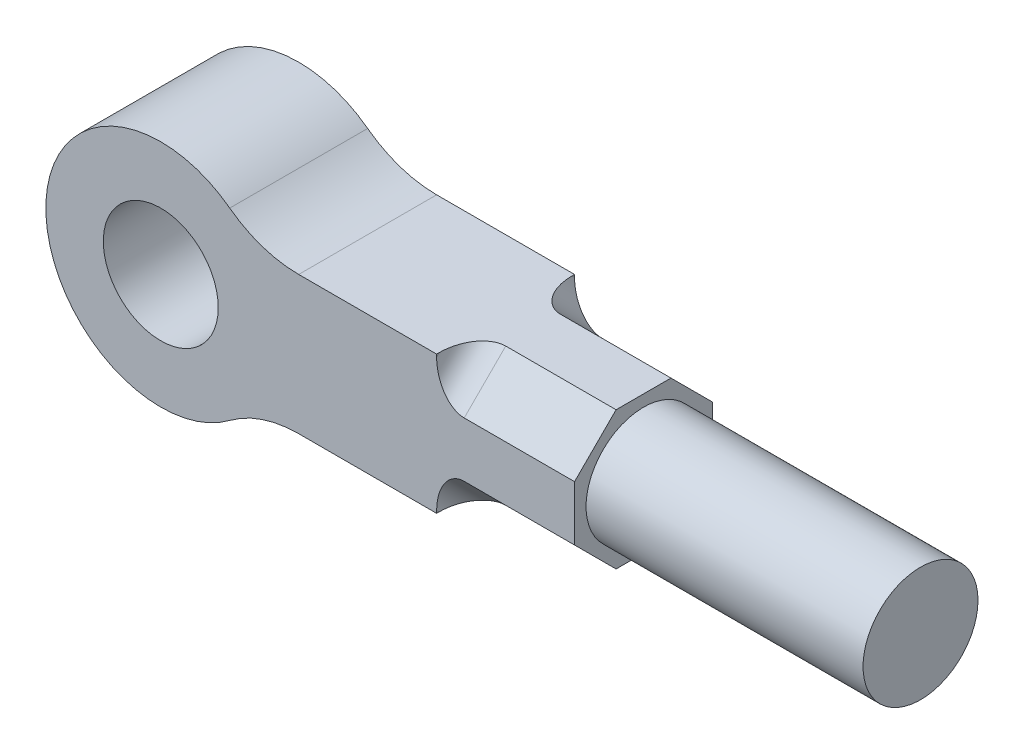
ISO-10303-21;
HEADER;
FILE_DESCRIPTION(('STEP AP214'),'2;1');
FILE_NAME('part.step','',(''),(''),'','','');
FILE_SCHEMA(('AUTOMOTIVE_DESIGN { 1 0 10303 214 1 1 1 1 }'));
ENDSEC;
DATA;
#1=APPLICATION_CONTEXT('core data for automotive mechanical design processes');
#2=APPLICATION_PROTOCOL_DEFINITION('international standard','automotive_design',2000,#1);
#3=PRODUCT_CONTEXT('',#1,'mechanical');
#4=PRODUCT('Part','Part','',(#3));
#5=PRODUCT_RELATED_PRODUCT_CATEGORY('part','',(#4));
#6=PRODUCT_DEFINITION_FORMATION('','',#4);
#7=PRODUCT_DEFINITION_CONTEXT('part definition',#1,'design');
#8=PRODUCT_DEFINITION('design','',#6,#7);
#9=PRODUCT_DEFINITION_SHAPE('','',#8);
#10=(LENGTH_UNIT() NAMED_UNIT(*) SI_UNIT(.MILLI.,.METRE.));
#11=(NAMED_UNIT(*) PLANE_ANGLE_UNIT() SI_UNIT($,.RADIAN.));
#12=(NAMED_UNIT(*) SI_UNIT($,.STERADIAN.) SOLID_ANGLE_UNIT());
#13=UNCERTAINTY_MEASURE_WITH_UNIT(LENGTH_MEASURE(1.E-05),#10,'distance_accuracy_value','');
#14=(GEOMETRIC_REPRESENTATION_CONTEXT(3) GLOBAL_UNCERTAINTY_ASSIGNED_CONTEXT((#13)) GLOBAL_UNIT_ASSIGNED_CONTEXT((#10,
#11,#12)) REPRESENTATION_CONTEXT('',''));
#15=CARTESIAN_POINT('',(0.,0.,0.));
#16=DIRECTION('',(0.,0.,1.));
#17=DIRECTION('',(1.,0.,0.));
#18=AXIS2_PLACEMENT_3D('',#15,#16,#17);
#19=CARTESIAN_POINT('',(600.,800.,600.));
#20=DIRECTION('',(0.,0.,-1.));
#21=DIRECTION('',(-1.,0.,0.));
#22=AXIS2_PLACEMENT_3D('',#19,#20,#21);
#23=PLANE('',#22);
#24=CARTESIAN_POINT('',(0.,0.,600.));
#25=DIRECTION('',(0.,0.,1.));
#26=DIRECTION('',(1.,0.,0.));
#27=AXIS2_PLACEMENT_3D('',#24,#25,#26);
#28=CIRCLE('',#27,250.);
#29=CARTESIAN_POINT('',(250.,0.,600.));
#30=VERTEX_POINT('',#29);
#31=EDGE_CURVE('E336',#30,#30,#28,.T.);
#32=ORIENTED_EDGE('',*,*,#31,.F.);
#33=EDGE_LOOP('',(#32));
#34=FACE_BOUND('',#33,.T.);
#35=DIRECTION('',(0.,-1.,0.));
#36=VECTOR('',#35,1.);
#37=CARTESIAN_POINT('',(1200.,0.,600.));
#38=LINE('',#37,#36);
#39=CARTESIAN_POINT('',(1200.,-289.105627484777,600.));
#40=VERTEX_POINT('',#39);
#41=CARTESIAN_POINT('',(1200.,-300.,600.));
#42=VERTEX_POINT('',#41);
#43=EDGE_CURVE('E371',#40,#42,#38,.T.);
#44=ORIENTED_EDGE('',*,*,#43,.F.);
#45=CARTESIAN_POINT('',(1320.,-289.105627484777,600.));
#46=DIRECTION('',(0.,0.,-1.));
#47=DIRECTION('',(0.,1.,0.));
#48=AXIS2_PLACEMENT_3D('',#45,#46,#47);
#49=ELLIPSE('',#48,169.705627484773,120.);
#50=CARTESIAN_POINT('',(1320.,-119.400000000004,600.));
#51=VERTEX_POINT('',#50);
#52=EDGE_CURVE('E299',#40,#51,#49,.T.);
#53=ORIENTED_EDGE('',*,*,#52,.T.);
#54=DIRECTION('',(1.,0.,0.));
#55=VECTOR('',#54,1.);
#56=CARTESIAN_POINT('',(1200.,-119.400000000004,600.));
#57=LINE('',#56,#55);
#58=CARTESIAN_POINT('',(1800.,-119.400000000004,600.));
#59=VERTEX_POINT('',#58);
#60=EDGE_CURVE('E379',#51,#59,#57,.T.);
#61=ORIENTED_EDGE('',*,*,#60,.T.);
#62=DIRECTION('',(0.,-1.,0.));
#63=VECTOR('',#62,1.);
#64=CARTESIAN_POINT('',(1800.,300.,600.));
#65=LINE('',#64,#63);
#66=CARTESIAN_POINT('',(1800.,119.399999999999,600.));
#67=VERTEX_POINT('',#66);
#68=EDGE_CURVE('E308',#67,#59,#65,.T.);
#69=ORIENTED_EDGE('',*,*,#68,.F.);
#70=DIRECTION('',(1.,0.,0.));
#71=VECTOR('',#70,1.);
#72=CARTESIAN_POINT('',(1200.,119.399999999999,600.));
#73=LINE('',#72,#71);
#74=CARTESIAN_POINT('',(1320.,119.399999999999,600.));
#75=VERTEX_POINT('',#74);
#76=EDGE_CURVE('E399',#75,#67,#73,.T.);
#77=ORIENTED_EDGE('',*,*,#76,.F.);
#78=CARTESIAN_POINT('',(1320.,289.105627484769,600.));
#79=DIRECTION('',(0.,0.,-1.));
#80=DIRECTION('',(0.,1.,0.));
#81=AXIS2_PLACEMENT_3D('',#78,#79,#80);
#82=ELLIPSE('',#81,169.70562748477,120.);
#83=CARTESIAN_POINT('',(1200.,289.105627484769,600.));
#84=VERTEX_POINT('',#83);
#85=EDGE_CURVE('E73',#75,#84,#82,.T.);
#86=ORIENTED_EDGE('',*,*,#85,.T.);
#87=DIRECTION('',(0.,-1.,0.));
#88=VECTOR('',#87,1.);
#89=CARTESIAN_POINT('',(1200.,0.,600.));
#90=LINE('',#89,#88);
#91=CARTESIAN_POINT('',(1200.,300.,600.));
#92=VERTEX_POINT('',#91);
#93=EDGE_CURVE('E391',#92,#84,#90,.T.);
#94=ORIENTED_EDGE('',*,*,#93,.F.);
#95=DIRECTION('',(1.,0.,0.));
#96=VECTOR('',#95,1.);
#97=CARTESIAN_POINT('',(600.,300.,600.));
#98=LINE('',#97,#96);
#99=CARTESIAN_POINT('',(600.,300.,600.));
#100=VERTEX_POINT('',#99);
#101=EDGE_CURVE('E240',#100,#92,#98,.T.);
#102=ORIENTED_EDGE('',*,*,#101,.F.);
#103=CARTESIAN_POINT('',(600.,800.,600.));
#104=DIRECTION('',(0.,0.,-1.));
#105=DIRECTION('',(-1.,0.,0.));
#106=AXIS2_PLACEMENT_3D('',#103,#104,#105);
#107=CIRCLE('',#106,500.);
#108=CARTESIAN_POINT('',(300.,400.,600.));
#109=VERTEX_POINT('',#108);
#110=EDGE_CURVE('E229',#100,#109,#107,.T.);
#111=ORIENTED_EDGE('',*,*,#110,.T.);
#112=CARTESIAN_POINT('',(0.,0.,600.));
#113=DIRECTION('',(0.,0.,1.));
#114=DIRECTION('',(1.,0.,0.));
#115=AXIS2_PLACEMENT_3D('',#112,#113,#114);
#116=CIRCLE('',#115,500.);
#117=CARTESIAN_POINT('',(300.,-400.,600.));
#118=VERTEX_POINT('',#117);
#119=EDGE_CURVE('E318',#109,#118,#116,.T.);
#120=ORIENTED_EDGE('',*,*,#119,.T.);
#121=CARTESIAN_POINT('',(600.,-800.,600.));
#122=DIRECTION('',(0.,0.,-1.));
#123=DIRECTION('',(-1.,0.,0.));
#124=AXIS2_PLACEMENT_3D('',#121,#122,#123);
#125=CIRCLE('',#124,500.);
#126=CARTESIAN_POINT('',(600.,-300.,600.));
#127=VERTEX_POINT('',#126);
#128=EDGE_CURVE('E315',#118,#127,#125,.T.);
#129=ORIENTED_EDGE('',*,*,#128,.T.);
#130=DIRECTION('',(1.,0.,0.));
#131=VECTOR('',#130,1.);
#132=CARTESIAN_POINT('',(600.,-300.,600.));
#133=LINE('',#132,#131);
#134=EDGE_CURVE('E311',#127,#42,#133,.T.);
#135=ORIENTED_EDGE('',*,*,#134,.T.);
#136=EDGE_LOOP('',(#44,#53,#61,#69,#77,#86,#94,#102,#111,#120,#129,#135));
#137=FACE_BOUND('',#136,.T.);
#138=ADVANCED_FACE('F64',(#34,#137),#23,.F.);
#139=CARTESIAN_POINT('',(600.,800.,0.));
#140=DIRECTION('',(0.,0.,-1.));
#141=DIRECTION('',(-1.,0.,0.));
#142=AXIS2_PLACEMENT_3D('',#139,#140,#141);
#143=PLANE('',#142);
#144=CARTESIAN_POINT('',(0.,0.,0.));
#145=DIRECTION('',(0.,0.,1.));
#146=DIRECTION('',(1.,0.,0.));
#147=AXIS2_PLACEMENT_3D('',#144,#145,#146);
#148=CIRCLE('',#147,250.);
#149=CARTESIAN_POINT('',(250.,0.,0.));
#150=VERTEX_POINT('',#149);
#151=EDGE_CURVE('E328',#150,#150,#148,.T.);
#152=ORIENTED_EDGE('',*,*,#151,.T.);
#153=EDGE_LOOP('',(#152));
#154=FACE_BOUND('',#153,.T.);
#155=DIRECTION('',(0.,-1.,0.));
#156=VECTOR('',#155,1.);
#157=CARTESIAN_POINT('',(1800.,300.,0.));
#158=LINE('',#157,#156);
#159=CARTESIAN_POINT('',(1800.,119.4,0.));
#160=VERTEX_POINT('',#159);
#161=CARTESIAN_POINT('',(1800.,-119.400000000009,0.));
#162=VERTEX_POINT('',#161);
#163=EDGE_CURVE('E194',#160,#162,#158,.T.);
#164=ORIENTED_EDGE('',*,*,#163,.T.);
#165=DIRECTION('',(1.,0.,0.));
#166=VECTOR('',#165,1.);
#167=CARTESIAN_POINT('',(1200.,-119.400000000009,0.));
#168=LINE('',#167,#166);
#169=CARTESIAN_POINT('',(1320.,-119.400000000009,0.));
#170=VERTEX_POINT('',#169);
#171=EDGE_CURVE('E214',#170,#162,#168,.T.);
#172=ORIENTED_EDGE('',*,*,#171,.F.);
#173=CARTESIAN_POINT('',(1320.,-289.10562748478,0.));
#174=DIRECTION('',(0.,0.,-1.));
#175=DIRECTION('',(0.,-1.,0.));
#176=AXIS2_PLACEMENT_3D('',#173,#174,#175);
#177=ELLIPSE('',#176,169.705627484771,120.);
#178=CARTESIAN_POINT('',(1200.,-289.10562748478,0.));
#179=VERTEX_POINT('',#178);
#180=EDGE_CURVE('E285',#170,#179,#177,.F.);
#181=ORIENTED_EDGE('',*,*,#180,.T.);
#182=DIRECTION('',(0.,1.,0.));
#183=VECTOR('',#182,1.);
#184=CARTESIAN_POINT('',(1200.,0.,0.));
#185=LINE('',#184,#183);
#186=CARTESIAN_POINT('',(1200.,-300.,0.));
#187=VERTEX_POINT('',#186);
#188=EDGE_CURVE('E354',#187,#179,#185,.T.);
#189=ORIENTED_EDGE('',*,*,#188,.F.);
#190=DIRECTION('',(1.,0.,0.));
#191=VECTOR('',#190,1.);
#192=CARTESIAN_POINT('',(600.,-300.,0.));
#193=LINE('',#192,#191);
#194=CARTESIAN_POINT('',(600.,-300.,0.));
#195=VERTEX_POINT('',#194);
#196=EDGE_CURVE('E224',#195,#187,#193,.T.);
#197=ORIENTED_EDGE('',*,*,#196,.F.);
#198=CARTESIAN_POINT('',(600.,-800.,0.));
#199=DIRECTION('',(0.,0.,-1.));
#200=DIRECTION('',(-1.,0.,0.));
#201=AXIS2_PLACEMENT_3D('',#198,#199,#200);
#202=CIRCLE('',#201,500.);
#203=CARTESIAN_POINT('',(300.,-400.,0.));
#204=VERTEX_POINT('',#203);
#205=EDGE_CURVE('E232',#204,#195,#202,.T.);
#206=ORIENTED_EDGE('',*,*,#205,.F.);
#207=CARTESIAN_POINT('',(0.,0.,0.));
#208=DIRECTION('',(0.,0.,1.));
#209=DIRECTION('',(1.,0.,0.));
#210=AXIS2_PLACEMENT_3D('',#207,#208,#209);
#211=CIRCLE('',#210,500.);
#212=CARTESIAN_POINT('',(300.,400.,0.));
#213=VERTEX_POINT('',#212);
#214=EDGE_CURVE('E335',#213,#204,#211,.T.);
#215=ORIENTED_EDGE('',*,*,#214,.F.);
#216=CARTESIAN_POINT('',(600.,800.,0.));
#217=DIRECTION('',(0.,0.,-1.));
#218=DIRECTION('',(-1.,0.,0.));
#219=AXIS2_PLACEMENT_3D('',#216,#217,#218);
#220=CIRCLE('',#219,500.);
#221=CARTESIAN_POINT('',(600.,300.,0.));
#222=VERTEX_POINT('',#221);
#223=EDGE_CURVE('E331',#222,#213,#220,.T.);
#224=ORIENTED_EDGE('',*,*,#223,.F.);
#225=DIRECTION('',(1.,0.,0.));
#226=VECTOR('',#225,1.);
#227=CARTESIAN_POINT('',(600.,300.,0.));
#228=LINE('',#227,#226);
#229=CARTESIAN_POINT('',(1200.,300.,0.));
#230=VERTEX_POINT('',#229);
#231=EDGE_CURVE('E223',#222,#230,#228,.T.);
#232=ORIENTED_EDGE('',*,*,#231,.T.);
#233=DIRECTION('',(0.,1.,0.));
#234=VECTOR('',#233,1.);
#235=CARTESIAN_POINT('',(1200.,0.,0.));
#236=LINE('',#235,#234);
#237=CARTESIAN_POINT('',(1200.,289.105627484772,0.));
#238=VERTEX_POINT('',#237);
#239=EDGE_CURVE('E213',#238,#230,#236,.T.);
#240=ORIENTED_EDGE('',*,*,#239,.F.);
#241=CARTESIAN_POINT('',(1320.,289.105627484772,0.));
#242=DIRECTION('',(0.,0.,-1.));
#243=DIRECTION('',(0.,-1.,0.));
#244=AXIS2_PLACEMENT_3D('',#241,#242,#243);
#245=ELLIPSE('',#244,169.705627484771,120.);
#246=CARTESIAN_POINT('',(1320.,119.4,0.));
#247=VERTEX_POINT('',#246);
#248=EDGE_CURVE('E197',#238,#247,#245,.F.);
#249=ORIENTED_EDGE('',*,*,#248,.T.);
#250=DIRECTION('',(1.,0.,0.));
#251=VECTOR('',#250,1.);
#252=CARTESIAN_POINT('',(1200.,119.4,0.));
#253=LINE('',#252,#251);
#254=EDGE_CURVE('E189',#247,#160,#253,.T.);
#255=ORIENTED_EDGE('',*,*,#254,.T.);
#256=EDGE_LOOP('',(#164,#172,#181,#189,#197,#206,#215,#224,#232,#240,#249,#255));
#257=FACE_BOUND('',#256,.T.);
#258=ADVANCED_FACE('F191',(#154,#257),#143,.T.);
#259=CARTESIAN_POINT('',(600.,-300.,600.));
#260=DIRECTION('',(0.,1.,0.));
#261=DIRECTION('',(0.,0.,1.));
#262=AXIS2_PLACEMENT_3D('',#259,#260,#261);
#263=PLANE('',#262);
#264=DIRECTION('',(1.,0.,0.));
#265=VECTOR('',#264,1.);
#266=CARTESIAN_POINT('',(1200.,-300.,419.400000000007));
#267=LINE('',#266,#265);
#268=CARTESIAN_POINT('',(1320.,-300.,419.400000000007));
#269=VERTEX_POINT('',#268);
#270=CARTESIAN_POINT('',(1800.,-300.,419.400000000007));
#271=VERTEX_POINT('',#270);
#272=EDGE_CURVE('E368',#269,#271,#267,.T.);
#273=ORIENTED_EDGE('',*,*,#272,.F.);
#274=CARTESIAN_POINT('',(1320.,-300.,589.105627484777));
#275=DIRECTION('',(0.,1.,0.));
#276=DIRECTION('',(0.,0.,1.));
#277=AXIS2_PLACEMENT_3D('',#274,#275,#276);
#278=ELLIPSE('',#277,169.70562748477,120.);
#279=CARTESIAN_POINT('',(1200.,-300.,589.105627484777));
#280=VERTEX_POINT('',#279);
#281=EDGE_CURVE('E296',#269,#280,#278,.T.);
#282=ORIENTED_EDGE('',*,*,#281,.T.);
#283=DIRECTION('',(0.,0.,-1.));
#284=VECTOR('',#283,1.);
#285=CARTESIAN_POINT('',(1200.,-300.,0.));
#286=LINE('',#285,#284);
#287=EDGE_CURVE('E374',#42,#280,#286,.T.);
#288=ORIENTED_EDGE('',*,*,#287,.F.);
#289=ORIENTED_EDGE('',*,*,#134,.F.);
#290=DIRECTION('',(0.,0.,-1.));
#291=VECTOR('',#290,1.);
#292=CARTESIAN_POINT('',(600.,-300.,600.));
#293=LINE('',#292,#291);
#294=EDGE_CURVE('E246',#127,#195,#293,.T.);
#295=ORIENTED_EDGE('',*,*,#294,.T.);
#296=ORIENTED_EDGE('',*,*,#196,.T.);
#297=DIRECTION('',(0.,0.,-1.));
#298=VECTOR('',#297,1.);
#299=CARTESIAN_POINT('',(1200.,-300.,0.));
#300=LINE('',#299,#298);
#301=CARTESIAN_POINT('',(1200.,-300.,10.8943725152201));
#302=VERTEX_POINT('',#301);
#303=EDGE_CURVE('E359',#302,#187,#300,.T.);
#304=ORIENTED_EDGE('',*,*,#303,.F.);
#305=CARTESIAN_POINT('',(1320.,-300.,10.8943725152201));
#306=DIRECTION('',(0.,1.,0.));
#307=DIRECTION('',(0.,0.,1.));
#308=AXIS2_PLACEMENT_3D('',#305,#306,#307);
#309=ELLIPSE('',#308,169.705627484772,120.);
#310=CARTESIAN_POINT('',(1320.,-300.,180.599999999992));
#311=VERTEX_POINT('',#310);
#312=EDGE_CURVE('E288',#302,#311,#309,.T.);
#313=ORIENTED_EDGE('',*,*,#312,.T.);
#314=DIRECTION('',(1.,0.,0.));
#315=VECTOR('',#314,1.);
#316=CARTESIAN_POINT('',(1200.,-300.,180.599999999992));
#317=LINE('',#316,#315);
#318=CARTESIAN_POINT('',(1800.,-300.,180.599999999992));
#319=VERTEX_POINT('',#318);
#320=EDGE_CURVE('E358',#311,#319,#317,.T.);
#321=ORIENTED_EDGE('',*,*,#320,.T.);
#322=DIRECTION('',(0.,0.,-1.));
#323=VECTOR('',#322,1.);
#324=CARTESIAN_POINT('',(1800.,-300.,600.));
#325=LINE('',#324,#323);
#326=EDGE_CURVE('E243',#271,#319,#325,.T.);
#327=ORIENTED_EDGE('',*,*,#326,.F.);
#328=EDGE_LOOP('',(#273,#282,#288,#289,#295,#296,#304,#313,#321,#327));
#329=FACE_BOUND('',#328,.T.);
#330=ADVANCED_FACE('F349',(#329),#263,.F.);
#331=CARTESIAN_POINT('',(1800.,300.,600.));
#332=DIRECTION('',(1.,0.,0.));
#333=DIRECTION('',(0.,0.,-1.));
#334=AXIS2_PLACEMENT_3D('',#331,#332,#333);
#335=PLANE('',#334);
#336=CARTESIAN_POINT('',(1800.,0.,300.));
#337=DIRECTION('',(1.,0.,0.));
#338=DIRECTION('',(0.,0.,-1.));
#339=AXIS2_PLACEMENT_3D('',#336,#337,#338);
#340=CIRCLE('',#339,250.);
#341=CARTESIAN_POINT('',(1800.,0.,50.));
#342=VERTEX_POINT('',#341);
#343=EDGE_CURVE('E258',#342,#342,#340,.T.);
#344=ORIENTED_EDGE('',*,*,#343,.F.);
#345=EDGE_LOOP('',(#344));
#346=FACE_BOUND('',#345,.T.);
#347=ORIENTED_EDGE('',*,*,#68,.T.);
#348=DIRECTION('',(0.,-0.707106781186552,-0.707106781186543));
#349=VECTOR('',#348,1.);
#350=CARTESIAN_POINT('',(1800.,-359.700000000001,359.700000000006));
#351=LINE('',#350,#349);
#352=EDGE_CURVE('E375',#59,#271,#351,.T.);
#353=ORIENTED_EDGE('',*,*,#352,.T.);
#354=ORIENTED_EDGE('',*,*,#326,.T.);
#355=DIRECTION('',(0.,0.707106781186545,-0.70710678118655));
#356=VECTOR('',#355,1.);
#357=CARTESIAN_POINT('',(1800.,-59.700000000005,-59.7000000000046));
#358=LINE('',#357,#356);
#359=EDGE_CURVE('E221',#319,#162,#358,.T.);
#360=ORIENTED_EDGE('',*,*,#359,.T.);
#361=ORIENTED_EDGE('',*,*,#163,.F.);
#362=DIRECTION('',(0.,0.707106781186548,0.707106781186548));
#363=VECTOR('',#362,1.);
#364=CARTESIAN_POINT('',(1800.,59.7,-59.7));
#365=LINE('',#364,#363);
#366=CARTESIAN_POINT('',(1800.,300.,180.6));
#367=VERTEX_POINT('',#366);
#368=EDGE_CURVE('E206',#160,#367,#365,.T.);
#369=ORIENTED_EDGE('',*,*,#368,.T.);
#370=DIRECTION('',(0.,0.,-1.));
#371=VECTOR('',#370,1.);
#372=CARTESIAN_POINT('',(1800.,300.,600.));
#373=LINE('',#372,#371);
#374=CARTESIAN_POINT('',(1800.,300.,419.399999999995));
#375=VERTEX_POINT('',#374);
#376=EDGE_CURVE('E239',#375,#367,#373,.T.);
#377=ORIENTED_EDGE('',*,*,#376,.F.);
#378=DIRECTION('',(0.,-0.70710678118654,0.707106781186555));
#379=VECTOR('',#378,1.);
#380=CARTESIAN_POINT('',(1800.,359.700000000001,359.699999999993));
#381=LINE('',#380,#379);
#382=EDGE_CURVE('E392',#375,#67,#381,.T.);
#383=ORIENTED_EDGE('',*,*,#382,.T.);
#384=EDGE_LOOP('',(#347,#353,#354,#360,#361,#369,#377,#383));
#385=FACE_BOUND('',#384,.T.);
#386=ADVANCED_FACE('F218',(#346,#385),#335,.T.);
#387=CARTESIAN_POINT('',(600.,300.,600.));
#388=DIRECTION('',(0.,1.,0.));
#389=DIRECTION('',(-1.,0.,0.));
#390=AXIS2_PLACEMENT_3D('',#387,#388,#389);
#391=PLANE('',#390);
#392=ORIENTED_EDGE('',*,*,#376,.T.);
#393=DIRECTION('',(1.,0.,0.));
#394=VECTOR('',#393,1.);
#395=CARTESIAN_POINT('',(1200.,300.,180.6));
#396=LINE('',#395,#394);
#397=CARTESIAN_POINT('',(1320.,300.,180.6));
#398=VERTEX_POINT('',#397);
#399=EDGE_CURVE('E202',#398,#367,#396,.T.);
#400=ORIENTED_EDGE('',*,*,#399,.F.);
#401=CARTESIAN_POINT('',(1320.,300.,10.8943725152285));
#402=DIRECTION('',(0.,1.,0.));
#403=DIRECTION('',(0.,0.,-1.));
#404=AXIS2_PLACEMENT_3D('',#401,#402,#403);
#405=ELLIPSE('',#404,169.705627484771,120.);
#406=CARTESIAN_POINT('',(1200.,300.,10.8943725152285));
#407=VERTEX_POINT('',#406);
#408=EDGE_CURVE('E291',#398,#407,#405,.F.);
#409=ORIENTED_EDGE('',*,*,#408,.T.);
#410=DIRECTION('',(0.,0.,1.));
#411=VECTOR('',#410,1.);
#412=CARTESIAN_POINT('',(1200.,300.,0.));
#413=LINE('',#412,#411);
#414=EDGE_CURVE('E203',#230,#407,#413,.T.);
#415=ORIENTED_EDGE('',*,*,#414,.F.);
#416=ORIENTED_EDGE('',*,*,#231,.F.);
#417=DIRECTION('',(0.,0.,-1.));
#418=VECTOR('',#417,1.);
#419=CARTESIAN_POINT('',(600.,300.,600.));
#420=LINE('',#419,#418);
#421=EDGE_CURVE('E236',#100,#222,#420,.T.);
#422=ORIENTED_EDGE('',*,*,#421,.F.);
#423=ORIENTED_EDGE('',*,*,#101,.T.);
#424=DIRECTION('',(0.,0.,1.));
#425=VECTOR('',#424,1.);
#426=CARTESIAN_POINT('',(1200.,300.,0.));
#427=LINE('',#426,#425);
#428=CARTESIAN_POINT('',(1200.,300.,589.105627484768));
#429=VERTEX_POINT('',#428);
#430=EDGE_CURVE('E388',#429,#92,#427,.T.);
#431=ORIENTED_EDGE('',*,*,#430,.F.);
#432=CARTESIAN_POINT('',(1320.,300.,589.105627484768));
#433=DIRECTION('',(0.,1.,0.));
#434=DIRECTION('',(0.,0.,-1.));
#435=AXIS2_PLACEMENT_3D('',#432,#433,#434);
#436=ELLIPSE('',#435,169.705627484773,120.);
#437=CARTESIAN_POINT('',(1320.,300.,419.399999999995));
#438=VERTEX_POINT('',#437);
#439=EDGE_CURVE('E12',#429,#438,#436,.F.);
#440=ORIENTED_EDGE('',*,*,#439,.T.);
#441=DIRECTION('',(1.,0.,0.));
#442=VECTOR('',#441,1.);
#443=CARTESIAN_POINT('',(1200.,300.,419.399999999995));
#444=LINE('',#443,#442);
#445=EDGE_CURVE('E395',#438,#375,#444,.T.);
#446=ORIENTED_EDGE('',*,*,#445,.T.);
#447=EDGE_LOOP('',(#392,#400,#409,#415,#416,#422,#423,#431,#440,#446));
#448=FACE_BOUND('',#447,.T.);
#449=ADVANCED_FACE('F433',(#448),#391,.T.);
#450=CARTESIAN_POINT('',(600.,800.,600.));
#451=DIRECTION('',(0.,0.,-1.));
#452=DIRECTION('',(-1.,0.,0.));
#453=AXIS2_PLACEMENT_3D('',#450,#451,#452);
#454=CYLINDRICAL_SURFACE('',#453,500.);
#455=ORIENTED_EDGE('',*,*,#223,.T.);
#456=DIRECTION('',(0.,0.,-1.));
#457=VECTOR('',#456,1.);
#458=CARTESIAN_POINT('',(300.,400.,600.));
#459=LINE('',#458,#457);
#460=EDGE_CURVE('E254',#109,#213,#459,.T.);
#461=ORIENTED_EDGE('',*,*,#460,.F.);
#462=ORIENTED_EDGE('',*,*,#110,.F.);
#463=ORIENTED_EDGE('',*,*,#421,.T.);
#464=EDGE_LOOP('',(#455,#461,#462,#463));
#465=FACE_BOUND('',#464,.T.);
#466=ADVANCED_FACE('F436',(#465),#454,.F.);
#467=CARTESIAN_POINT('',(0.,0.,600.));
#468=DIRECTION('',(0.,0.,-1.));
#469=DIRECTION('',(-1.,0.,0.));
#470=AXIS2_PLACEMENT_3D('',#467,#468,#469);
#471=CYLINDRICAL_SURFACE('',#470,500.);
#472=ORIENTED_EDGE('',*,*,#214,.T.);
#473=DIRECTION('',(0.,0.,-1.));
#474=VECTOR('',#473,1.);
#475=CARTESIAN_POINT('',(300.,-400.,600.));
#476=LINE('',#475,#474);
#477=EDGE_CURVE('E250',#118,#204,#476,.T.);
#478=ORIENTED_EDGE('',*,*,#477,.F.);
#479=ORIENTED_EDGE('',*,*,#119,.F.);
#480=ORIENTED_EDGE('',*,*,#460,.T.);
#481=EDGE_LOOP('',(#472,#478,#479,#480));
#482=FACE_BOUND('',#481,.T.);
#483=ADVANCED_FACE('F423',(#482),#471,.T.);
#484=CARTESIAN_POINT('',(600.,-800.,600.));
#485=DIRECTION('',(0.,0.,-1.));
#486=DIRECTION('',(-1.,0.,0.));
#487=AXIS2_PLACEMENT_3D('',#484,#485,#486);
#488=CYLINDRICAL_SURFACE('',#487,500.);
#489=ORIENTED_EDGE('',*,*,#205,.T.);
#490=ORIENTED_EDGE('',*,*,#294,.F.);
#491=ORIENTED_EDGE('',*,*,#128,.F.);
#492=ORIENTED_EDGE('',*,*,#477,.T.);
#493=EDGE_LOOP('',(#489,#490,#491,#492));
#494=FACE_BOUND('',#493,.T.);
#495=ADVANCED_FACE('F342',(#494),#488,.F.);
#496=CARTESIAN_POINT('',(0.,0.,600.));
#497=DIRECTION('',(0.,0.,-1.));
#498=DIRECTION('',(-1.,0.,0.));
#499=AXIS2_PLACEMENT_3D('',#496,#497,#498);
#500=CYLINDRICAL_SURFACE('',#499,250.);
#501=ORIENTED_EDGE('',*,*,#31,.T.);
#502=EDGE_LOOP('',(#501));
#503=FACE_BOUND('',#502,.T.);
#504=ORIENTED_EDGE('',*,*,#151,.F.);
#505=EDGE_LOOP('',(#504));
#506=FACE_BOUND('',#505,.T.);
#507=ADVANCED_FACE('F412',(#503,#506),#500,.F.);
#508=CARTESIAN_POINT('',(1200.,359.700000000001,359.699999999993));
#509=DIRECTION('',(0.,0.707106781186555,0.70710678118654));
#510=DIRECTION('',(0.,-0.70710678118654,0.707106781186555));
#511=AXIS2_PLACEMENT_3D('',#508,#509,#510);
#512=PLANE('',#511);
#513=ORIENTED_EDGE('',*,*,#445,.F.);
#514=DIRECTION('',(0.,-0.70710678118654,0.707106781186555));
#515=VECTOR('',#514,1.);
#516=CARTESIAN_POINT('',(1320.,119.399999999999,600.));
#517=LINE('',#516,#515);
#518=EDGE_CURVE('E279',#438,#75,#517,.T.);
#519=ORIENTED_EDGE('',*,*,#518,.T.);
#520=ORIENTED_EDGE('',*,*,#76,.T.);
#521=ORIENTED_EDGE('',*,*,#382,.F.);
#522=EDGE_LOOP('',(#513,#519,#520,#521));
#523=FACE_BOUND('',#522,.T.);
#524=ADVANCED_FACE('F414',(#523),#512,.T.);
#525=CARTESIAN_POINT('',(1200.,0.,0.));
#526=DIRECTION('',(1.,0.,0.));
#527=DIRECTION('',(0.,0.,-1.));
#528=AXIS2_PLACEMENT_3D('',#525,#526,#527);
#529=PLANE('',#528);
#530=ORIENTED_EDGE('',*,*,#93,.T.);
#531=DIRECTION('',(0.,-0.70710678118654,0.707106781186555));
#532=VECTOR('',#531,1.);
#533=CARTESIAN_POINT('',(1200.,384.852813742387,504.25281374238));
#534=LINE('',#533,#532);
#535=EDGE_CURVE('E86',#84,#429,#534,.F.);
#536=ORIENTED_EDGE('',*,*,#535,.T.);
#537=ORIENTED_EDGE('',*,*,#430,.T.);
#538=EDGE_LOOP('',(#530,#536,#537));
#539=FACE_BOUND('',#538,.T.);
#540=ADVANCED_FACE('F420',(#539),#529,.T.);
#541=CARTESIAN_POINT('',(1200.,59.7,-59.7));
#542=DIRECTION('',(0.,0.707106781186548,-0.707106781186548));
#543=DIRECTION('',(0.,0.707106781186548,0.707106781186548));
#544=AXIS2_PLACEMENT_3D('',#541,#542,#543);
#545=PLANE('',#544);
#546=ORIENTED_EDGE('',*,*,#254,.F.);
#547=DIRECTION('',(0.,0.707106781186548,0.707106781186548));
#548=VECTOR('',#547,1.);
#549=CARTESIAN_POINT('',(1320.,300.,180.6));
#550=LINE('',#549,#548);
#551=EDGE_CURVE('E266',#247,#398,#550,.T.);
#552=ORIENTED_EDGE('',*,*,#551,.T.);
#553=ORIENTED_EDGE('',*,*,#399,.T.);
#554=ORIENTED_EDGE('',*,*,#368,.F.);
#555=EDGE_LOOP('',(#546,#552,#553,#554));
#556=FACE_BOUND('',#555,.T.);
#557=ADVANCED_FACE('F207',(#556),#545,.T.);
#558=CARTESIAN_POINT('',(1200.,0.,0.));
#559=DIRECTION('',(1.,0.,0.));
#560=DIRECTION('',(0.,0.,-1.));
#561=AXIS2_PLACEMENT_3D('',#558,#559,#560);
#562=PLANE('',#561);
#563=ORIENTED_EDGE('',*,*,#414,.T.);
#564=DIRECTION('',(0.,0.707106781186548,0.707106781186548));
#565=VECTOR('',#564,1.);
#566=CARTESIAN_POINT('',(1200.,204.252813742386,-84.8528137423857));
#567=LINE('',#566,#565);
#568=EDGE_CURVE('E269',#407,#238,#567,.F.);
#569=ORIENTED_EDGE('',*,*,#568,.T.);
#570=ORIENTED_EDGE('',*,*,#239,.T.);
#571=EDGE_LOOP('',(#563,#569,#570));
#572=FACE_BOUND('',#571,.T.);
#573=ADVANCED_FACE('F483',(#572),#562,.T.);
#574=CARTESIAN_POINT('',(1200.,-59.700000000005,-59.7000000000046));
#575=DIRECTION('',(0.,-0.70710678118655,-0.707106781186545));
#576=DIRECTION('',(0.,0.707106781186545,-0.70710678118655));
#577=AXIS2_PLACEMENT_3D('',#574,#575,#576);
#578=PLANE('',#577);
#579=ORIENTED_EDGE('',*,*,#320,.F.);
#580=DIRECTION('',(0.,0.707106781186545,-0.70710678118655));
#581=VECTOR('',#580,1.);
#582=CARTESIAN_POINT('',(1320.,-119.400000000009,0.));
#583=LINE('',#582,#581);
#584=EDGE_CURVE('E259',#311,#170,#583,.T.);
#585=ORIENTED_EDGE('',*,*,#584,.T.);
#586=ORIENTED_EDGE('',*,*,#171,.T.);
#587=ORIENTED_EDGE('',*,*,#359,.F.);
#588=EDGE_LOOP('',(#579,#585,#586,#587));
#589=FACE_BOUND('',#588,.T.);
#590=ADVANCED_FACE('F494',(#589),#578,.T.);
#591=CARTESIAN_POINT('',(1200.,0.,0.));
#592=DIRECTION('',(1.,0.,0.));
#593=DIRECTION('',(0.,0.,-1.));
#594=AXIS2_PLACEMENT_3D('',#591,#592,#593);
#595=PLANE('',#594);
#596=ORIENTED_EDGE('',*,*,#188,.T.);
#597=DIRECTION('',(0.,0.707106781186545,-0.70710678118655));
#598=VECTOR('',#597,1.);
#599=CARTESIAN_POINT('',(1200.,-384.852813742386,95.7471862576066));
#600=LINE('',#599,#598);
#601=EDGE_CURVE('E263',#179,#302,#600,.F.);
#602=ORIENTED_EDGE('',*,*,#601,.T.);
#603=ORIENTED_EDGE('',*,*,#303,.T.);
#604=EDGE_LOOP('',(#596,#602,#603));
#605=FACE_BOUND('',#604,.T.);
#606=ADVANCED_FACE('F489',(#605),#595,.T.);
#607=CARTESIAN_POINT('',(1200.,-359.700000000001,359.700000000006));
#608=DIRECTION('',(0.,-0.707106781186543,0.707106781186552));
#609=DIRECTION('',(0.,-0.707106781186552,-0.707106781186543));
#610=AXIS2_PLACEMENT_3D('',#607,#608,#609);
#611=PLANE('',#610);
#612=ORIENTED_EDGE('',*,*,#60,.F.);
#613=DIRECTION('',(0.,-0.707106781186552,-0.707106781186543));
#614=VECTOR('',#613,1.);
#615=CARTESIAN_POINT('',(1320.,-300.,419.400000000007));
#616=LINE('',#615,#614);
#617=EDGE_CURVE('E272',#51,#269,#616,.T.);
#618=ORIENTED_EDGE('',*,*,#617,.T.);
#619=ORIENTED_EDGE('',*,*,#272,.T.);
#620=ORIENTED_EDGE('',*,*,#352,.F.);
#621=EDGE_LOOP('',(#612,#618,#619,#620));
#622=FACE_BOUND('',#621,.T.);
#623=ADVANCED_FACE('F472',(#622),#611,.T.);
#624=CARTESIAN_POINT('',(1200.,0.,0.));
#625=DIRECTION('',(1.,0.,0.));
#626=DIRECTION('',(0.,0.,-1.));
#627=AXIS2_PLACEMENT_3D('',#624,#625,#626);
#628=PLANE('',#627);
#629=ORIENTED_EDGE('',*,*,#287,.T.);
#630=DIRECTION('',(0.,-0.707106781186552,-0.707106781186543));
#631=VECTOR('',#630,1.);
#632=CARTESIAN_POINT('',(1200.,-204.25281374239,684.852813742386));
#633=LINE('',#632,#631);
#634=EDGE_CURVE('E276',#280,#40,#633,.F.);
#635=ORIENTED_EDGE('',*,*,#634,.T.);
#636=ORIENTED_EDGE('',*,*,#43,.T.);
#637=EDGE_LOOP('',(#629,#635,#636));
#638=FACE_BOUND('',#637,.T.);
#639=ADVANCED_FACE('F488',(#638),#628,.T.);
#640=CARTESIAN_POINT('',(3005.,0.,300.));
#641=DIRECTION('',(-1.,0.,0.));
#642=DIRECTION('',(0.,0.,1.));
#643=AXIS2_PLACEMENT_3D('',#640,#641,#642);
#644=CYLINDRICAL_SURFACE('',#643,250.);
#645=CARTESIAN_POINT('',(3005.,0.,300.));
#646=DIRECTION('',(1.,0.,0.));
#647=DIRECTION('',(0.,0.,-1.));
#648=AXIS2_PLACEMENT_3D('',#645,#646,#647);
#649=CIRCLE('',#648,250.);
#650=CARTESIAN_POINT('',(3005.,0.,50.));
#651=VERTEX_POINT('',#650);
#652=EDGE_CURVE('E383',#651,#651,#649,.T.);
#653=ORIENTED_EDGE('',*,*,#652,.F.);
#654=EDGE_LOOP('',(#653));
#655=FACE_BOUND('',#654,.T.);
#656=ORIENTED_EDGE('',*,*,#343,.T.);
#657=EDGE_LOOP('',(#656));
#658=FACE_BOUND('',#657,.T.);
#659=ADVANCED_FACE('F492',(#655,#658),#644,.T.);
#660=CARTESIAN_POINT('',(3005.,0.,0.));
#661=DIRECTION('',(1.,0.,0.));
#662=DIRECTION('',(0.,0.,-1.));
#663=AXIS2_PLACEMENT_3D('',#660,#661,#662);
#664=PLANE('',#663);
#665=ORIENTED_EDGE('',*,*,#652,.T.);
#666=EDGE_LOOP('',(#665));
#667=FACE_BOUND('',#666,.T.);
#668=ADVANCED_FACE('F453',(#667),#664,.T.);
#669=CARTESIAN_POINT('',(1320.,-144.552813742391,-144.55281374239));
#670=DIRECTION('',(0.,-0.707106781186545,0.70710678118655));
#671=DIRECTION('',(0.,-0.70710678118655,-0.707106781186545));
#672=AXIS2_PLACEMENT_3D('',#669,#670,#671);
#673=CYLINDRICAL_SURFACE('',#672,120.);
#674=ORIENTED_EDGE('',*,*,#312,.F.);
#675=ORIENTED_EDGE('',*,*,#601,.F.);
#676=ORIENTED_EDGE('',*,*,#180,.F.);
#677=ORIENTED_EDGE('',*,*,#584,.F.);
#678=EDGE_LOOP('',(#674,#675,#676,#677));
#679=FACE_BOUND('',#678,.T.);
#680=ADVANCED_FACE('F449',(#679),#673,.F.);
#681=CARTESIAN_POINT('',(1320.,144.552813742386,-144.552813742386));
#682=DIRECTION('',(0.,-0.707106781186548,-0.707106781186548));
#683=DIRECTION('',(0.,0.707106781186548,-0.707106781186548));
#684=AXIS2_PLACEMENT_3D('',#681,#682,#683);
#685=CYLINDRICAL_SURFACE('',#684,120.);
#686=ORIENTED_EDGE('',*,*,#248,.F.);
#687=ORIENTED_EDGE('',*,*,#568,.F.);
#688=ORIENTED_EDGE('',*,*,#408,.F.);
#689=ORIENTED_EDGE('',*,*,#551,.F.);
#690=EDGE_LOOP('',(#686,#687,#688,#689));
#691=FACE_BOUND('',#690,.T.);
#692=ADVANCED_FACE('F452',(#691),#685,.F.);
#693=CARTESIAN_POINT('',(1320.,-444.552813742386,444.552813742392));
#694=DIRECTION('',(0.,0.707106781186552,0.707106781186543));
#695=DIRECTION('',(0.,-0.707106781186543,0.707106781186552));
#696=AXIS2_PLACEMENT_3D('',#693,#694,#695);
#697=CYLINDRICAL_SURFACE('',#696,120.);
#698=ORIENTED_EDGE('',*,*,#52,.F.);
#699=ORIENTED_EDGE('',*,*,#634,.F.);
#700=ORIENTED_EDGE('',*,*,#281,.F.);
#701=ORIENTED_EDGE('',*,*,#617,.F.);
#702=EDGE_LOOP('',(#698,#699,#700,#701));
#703=FACE_BOUND('',#702,.T.);
#704=ADVANCED_FACE('F456',(#703),#697,.F.);
#705=CARTESIAN_POINT('',(1320.,444.552813742387,444.552813742378));
#706=DIRECTION('',(0.,0.70710678118654,-0.707106781186555));
#707=DIRECTION('',(0.,0.707106781186555,0.70710678118654));
#708=AXIS2_PLACEMENT_3D('',#705,#706,#707);
#709=CYLINDRICAL_SURFACE('',#708,120.);
#710=ORIENTED_EDGE('',*,*,#439,.F.);
#711=ORIENTED_EDGE('',*,*,#535,.F.);
#712=ORIENTED_EDGE('',*,*,#85,.F.);
#713=ORIENTED_EDGE('',*,*,#518,.F.);
#714=EDGE_LOOP('',(#710,#711,#712,#713));
#715=FACE_BOUND('',#714,.T.);
#716=ADVANCED_FACE('F66',(#715),#709,.F.);
#717=CLOSED_SHELL('',(#138,#258,#330,#386,#449,#466,#483,#495,#507,#524,#540,#557,#573,#590,
#606,#623,#639,#659,#668,#680,#692,#704,#716));
#718=MANIFOLD_SOLID_BREP('B2',#717);
#719=ADVANCED_BREP_SHAPE_REPRESENTATION('',(#18,#718),#14);
#720=SHAPE_DEFINITION_REPRESENTATION(#9,#719);
ENDSEC;
END-ISO-10303-21;
